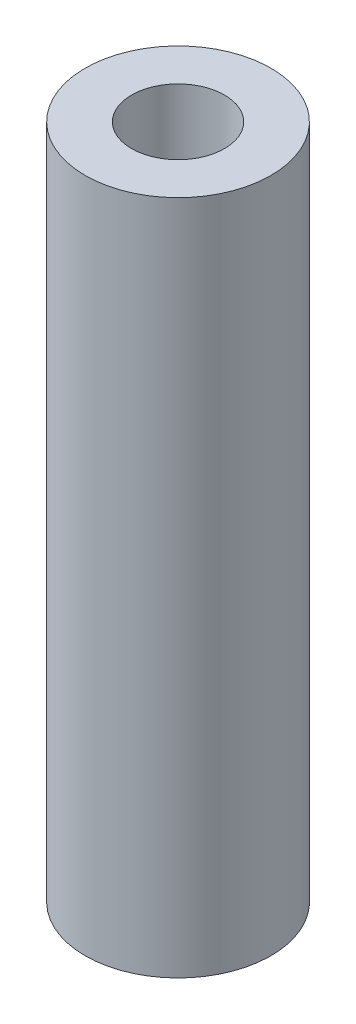
ISO-10303-21;
HEADER;
FILE_DESCRIPTION(('STEP AP214'),'2;1');
FILE_NAME('part.step','',(''),(''),'','','');
FILE_SCHEMA(('AUTOMOTIVE_DESIGN { 1 0 10303 214 1 1 1 1 }'));
ENDSEC;
DATA;
#1=APPLICATION_CONTEXT('core data for automotive mechanical design processes');
#2=APPLICATION_PROTOCOL_DEFINITION('international standard','automotive_design',2000,#1);
#3=PRODUCT_CONTEXT('',#1,'mechanical');
#4=PRODUCT('Part','Part','',(#3));
#5=PRODUCT_RELATED_PRODUCT_CATEGORY('part','',(#4));
#6=PRODUCT_DEFINITION_FORMATION('','',#4);
#7=PRODUCT_DEFINITION_CONTEXT('part definition',#1,'design');
#8=PRODUCT_DEFINITION('design','',#6,#7);
#9=PRODUCT_DEFINITION_SHAPE('','',#8);
#10=(LENGTH_UNIT() NAMED_UNIT(*) SI_UNIT(.MILLI.,.METRE.));
#11=(NAMED_UNIT(*) PLANE_ANGLE_UNIT() SI_UNIT($,.RADIAN.));
#12=(NAMED_UNIT(*) SI_UNIT($,.STERADIAN.) SOLID_ANGLE_UNIT());
#13=UNCERTAINTY_MEASURE_WITH_UNIT(LENGTH_MEASURE(1.E-05),#10,'distance_accuracy_value','');
#14=(GEOMETRIC_REPRESENTATION_CONTEXT(3) GLOBAL_UNCERTAINTY_ASSIGNED_CONTEXT((#13)) GLOBAL_UNIT_ASSIGNED_CONTEXT((#10,
#11,#12)) REPRESENTATION_CONTEXT('',''));
#15=CARTESIAN_POINT('',(0.,0.,0.));
#16=DIRECTION('',(0.,0.,1.));
#17=DIRECTION('',(1.,0.,0.));
#18=AXIS2_PLACEMENT_3D('',#15,#16,#17);
#19=CARTESIAN_POINT('',(0.,80.,0.));
#20=DIRECTION('',(0.,1.,0.));
#21=DIRECTION('',(0.,0.,1.));
#22=AXIS2_PLACEMENT_3D('',#19,#20,#21);
#23=PLANE('',#22);
#24=CARTESIAN_POINT('',(0.,80.,0.));
#25=DIRECTION('',(0.,1.,0.));
#26=DIRECTION('',(0.,0.,1.));
#27=AXIS2_PLACEMENT_3D('',#24,#25,#26);
#28=CIRCLE('',#27,11.);
#29=CARTESIAN_POINT('',(0.,80.,11.));
#30=VERTEX_POINT('',#29);
#31=EDGE_CURVE('E10',#30,#30,#28,.T.);
#32=ORIENTED_EDGE('',*,*,#31,.T.);
#33=EDGE_LOOP('',(#32));
#34=FACE_BOUND('',#33,.T.);
#35=CARTESIAN_POINT('',(0.,80.,0.));
#36=DIRECTION('',(0.,1.,0.));
#37=DIRECTION('',(0.,0.,1.));
#38=AXIS2_PLACEMENT_3D('',#35,#36,#37);
#39=CIRCLE('',#38,5.5);
#40=CARTESIAN_POINT('',(0.,80.,5.5));
#41=VERTEX_POINT('',#40);
#42=EDGE_CURVE('E55',#41,#41,#39,.T.);
#43=ORIENTED_EDGE('',*,*,#42,.F.);
#44=EDGE_LOOP('',(#43));
#45=FACE_BOUND('',#44,.T.);
#46=ADVANCED_FACE('F41',(#34,#45),#23,.T.);
#47=CARTESIAN_POINT('',(0.,0.,0.));
#48=DIRECTION('',(0.,1.,0.));
#49=DIRECTION('',(0.,0.,1.));
#50=AXIS2_PLACEMENT_3D('',#47,#48,#49);
#51=PLANE('',#50);
#52=CARTESIAN_POINT('',(0.,0.,0.));
#53=DIRECTION('',(0.,1.,0.));
#54=DIRECTION('',(0.,0.,1.));
#55=AXIS2_PLACEMENT_3D('',#52,#53,#54);
#56=CIRCLE('',#55,11.);
#57=CARTESIAN_POINT('',(0.,0.,11.));
#58=VERTEX_POINT('',#57);
#59=EDGE_CURVE('E45',#58,#58,#56,.T.);
#60=ORIENTED_EDGE('',*,*,#59,.F.);
#61=EDGE_LOOP('',(#60));
#62=FACE_BOUND('',#61,.T.);
#63=CARTESIAN_POINT('',(0.,0.,0.));
#64=DIRECTION('',(0.,1.,0.));
#65=DIRECTION('',(0.,0.,1.));
#66=AXIS2_PLACEMENT_3D('',#63,#64,#65);
#67=CIRCLE('',#66,5.5);
#68=CARTESIAN_POINT('',(0.,0.,5.5));
#69=VERTEX_POINT('',#68);
#70=EDGE_CURVE('E57',#69,#69,#67,.T.);
#71=ORIENTED_EDGE('',*,*,#70,.T.);
#72=EDGE_LOOP('',(#71));
#73=FACE_BOUND('',#72,.T.);
#74=ADVANCED_FACE('F68',(#62,#73),#51,.F.);
#75=CARTESIAN_POINT('',(0.,80.,0.));
#76=DIRECTION('',(0.,-1.,0.));
#77=DIRECTION('',(0.,0.,-1.));
#78=AXIS2_PLACEMENT_3D('',#75,#76,#77);
#79=CYLINDRICAL_SURFACE('',#78,11.);
#80=ORIENTED_EDGE('',*,*,#31,.F.);
#81=EDGE_LOOP('',(#80));
#82=FACE_BOUND('',#81,.T.);
#83=ORIENTED_EDGE('',*,*,#59,.T.);
#84=EDGE_LOOP('',(#83));
#85=FACE_BOUND('',#84,.T.);
#86=ADVANCED_FACE('F43',(#82,#85),#79,.T.);
#87=CARTESIAN_POINT('',(0.,80.,0.));
#88=DIRECTION('',(0.,-1.,0.));
#89=DIRECTION('',(0.,0.,-1.));
#90=AXIS2_PLACEMENT_3D('',#87,#88,#89);
#91=CYLINDRICAL_SURFACE('',#90,5.5);
#92=ORIENTED_EDGE('',*,*,#42,.T.);
#93=EDGE_LOOP('',(#92));
#94=FACE_BOUND('',#93,.T.);
#95=ORIENTED_EDGE('',*,*,#70,.F.);
#96=EDGE_LOOP('',(#95));
#97=FACE_BOUND('',#96,.T.);
#98=ADVANCED_FACE('F64',(#94,#97),#91,.F.);
#99=CLOSED_SHELL('',(#46,#74,#86,#98));
#100=MANIFOLD_SOLID_BREP('B2',#99);
#101=ADVANCED_BREP_SHAPE_REPRESENTATION('',(#18,#100),#14);
#102=SHAPE_DEFINITION_REPRESENTATION(#9,#101);
ENDSEC;
END-ISO-10303-21;
